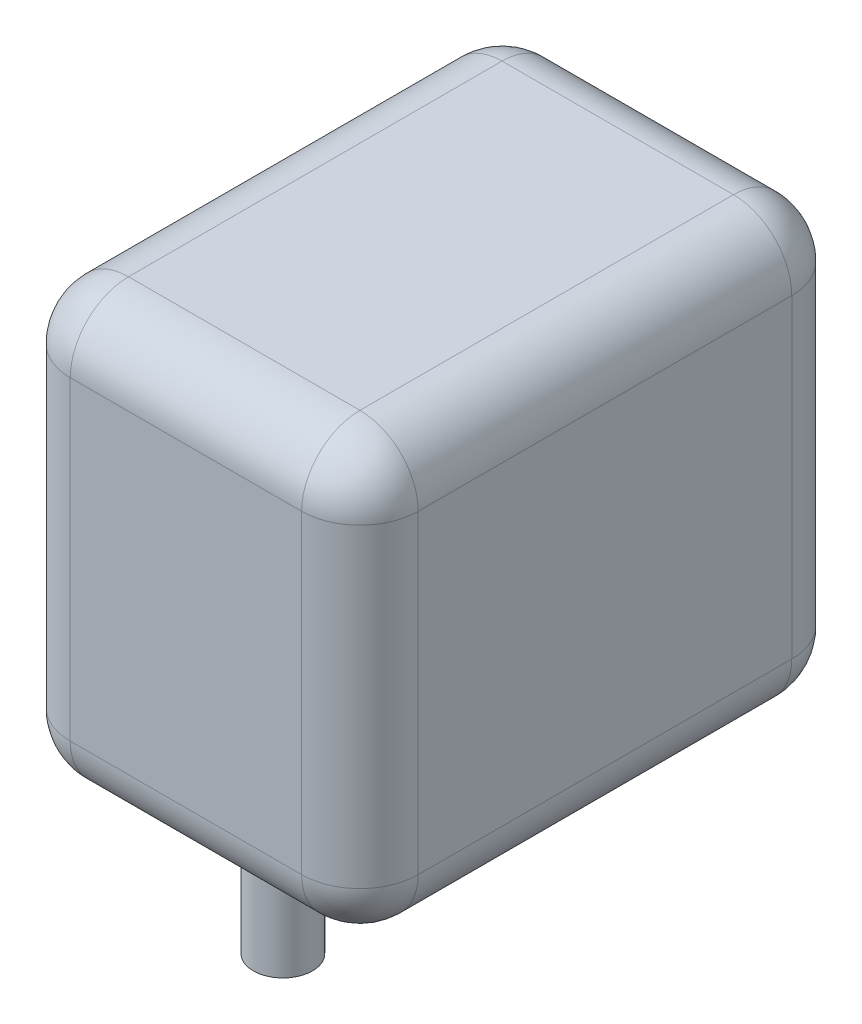
ISO-10303-21;
HEADER;
FILE_DESCRIPTION(('STEP AP214'),'2;1');
FILE_NAME('part.step','',(''),(''),'','','');
FILE_SCHEMA(('AUTOMOTIVE_DESIGN { 1 0 10303 214 1 1 1 1 }'));
ENDSEC;
DATA;
#1=APPLICATION_CONTEXT('core data for automotive mechanical design processes');
#2=APPLICATION_PROTOCOL_DEFINITION('international standard','automotive_design',2000,#1);
#3=PRODUCT_CONTEXT('',#1,'mechanical');
#4=PRODUCT('Part','Part','',(#3));
#5=PRODUCT_RELATED_PRODUCT_CATEGORY('part','',(#4));
#6=PRODUCT_DEFINITION_FORMATION('','',#4);
#7=PRODUCT_DEFINITION_CONTEXT('part definition',#1,'design');
#8=PRODUCT_DEFINITION('design','',#6,#7);
#9=PRODUCT_DEFINITION_SHAPE('','',#8);
#10=(LENGTH_UNIT() NAMED_UNIT(*) SI_UNIT(.MILLI.,.METRE.));
#11=(NAMED_UNIT(*) PLANE_ANGLE_UNIT() SI_UNIT($,.RADIAN.));
#12=(NAMED_UNIT(*) SI_UNIT($,.STERADIAN.) SOLID_ANGLE_UNIT());
#13=UNCERTAINTY_MEASURE_WITH_UNIT(LENGTH_MEASURE(1.E-05),#10,'distance_accuracy_value','');
#14=(GEOMETRIC_REPRESENTATION_CONTEXT(3) GLOBAL_UNCERTAINTY_ASSIGNED_CONTEXT((#13)) GLOBAL_UNIT_ASSIGNED_CONTEXT((#10,
#11,#12)) REPRESENTATION_CONTEXT('',''));
#15=CARTESIAN_POINT('',(0.,0.,0.));
#16=DIRECTION('',(0.,0.,1.));
#17=DIRECTION('',(1.,0.,0.));
#18=AXIS2_PLACEMENT_3D('',#15,#16,#17);
#19=CARTESIAN_POINT('',(29.845,93.98,-42.037));
#20=DIRECTION('',(-1.,0.,0.));
#21=DIRECTION('',(0.,0.,1.));
#22=AXIS2_PLACEMENT_3D('',#19,#20,#21);
#23=PLANE('',#22);
#24=DIRECTION('',(0.,-1.,0.));
#25=VECTOR('',#24,1.);
#26=CARTESIAN_POINT('',(29.845,93.98,-32.037));
#27=LINE('',#26,#25);
#28=CARTESIAN_POINT('',(29.845,30.,-32.037));
#29=VERTEX_POINT('',#28);
#30=CARTESIAN_POINT('',(29.845,83.98,-32.037));
#31=VERTEX_POINT('',#30);
#32=EDGE_CURVE('E189',#29,#31,#27,.F.);
#33=ORIENTED_EDGE('',*,*,#32,.T.);
#34=DIRECTION('',(0.,0.,-1.));
#35=VECTOR('',#34,1.);
#36=CARTESIAN_POINT('',(29.845,83.98,42.037));
#37=LINE('',#36,#35);
#38=CARTESIAN_POINT('',(29.845,83.98,32.037));
#39=VERTEX_POINT('',#38);
#40=EDGE_CURVE('E191',#31,#39,#37,.F.);
#41=ORIENTED_EDGE('',*,*,#40,.T.);
#42=DIRECTION('',(0.,-1.,0.));
#43=VECTOR('',#42,1.);
#44=CARTESIAN_POINT('',(29.845,93.98,32.037));
#45=LINE('',#44,#43);
#46=CARTESIAN_POINT('',(29.845,30.,32.037));
#47=VERTEX_POINT('',#46);
#48=EDGE_CURVE('E185',#39,#47,#45,.T.);
#49=ORIENTED_EDGE('',*,*,#48,.T.);
#50=DIRECTION('',(0.,0.,1.));
#51=VECTOR('',#50,1.);
#52=CARTESIAN_POINT('',(29.845,30.,-42.037));
#53=LINE('',#52,#51);
#54=EDGE_CURVE('E187',#47,#29,#53,.F.);
#55=ORIENTED_EDGE('',*,*,#54,.T.);
#56=EDGE_LOOP('',(#33,#41,#49,#55));
#57=FACE_BOUND('',#56,.T.);
#58=ADVANCED_FACE('F32',(#57),#23,.F.);
#59=CARTESIAN_POINT('',(-29.845,93.98,-42.037));
#60=DIRECTION('',(0.,0.,1.));
#61=DIRECTION('',(1.,0.,0.));
#62=AXIS2_PLACEMENT_3D('',#59,#60,#61);
#63=PLANE('',#62);
#64=DIRECTION('',(0.,-1.,0.));
#65=VECTOR('',#64,1.);
#66=CARTESIAN_POINT('',(-19.845,93.98,-42.037));
#67=LINE('',#66,#65);
#68=CARTESIAN_POINT('',(-19.845,30.,-42.037));
#69=VERTEX_POINT('',#68);
#70=CARTESIAN_POINT('',(-19.845,83.98,-42.037));
#71=VERTEX_POINT('',#70);
#72=EDGE_CURVE('E180',#69,#71,#67,.F.);
#73=ORIENTED_EDGE('',*,*,#72,.T.);
#74=DIRECTION('',(-1.,0.,0.));
#75=VECTOR('',#74,1.);
#76=CARTESIAN_POINT('',(29.845,83.98,-42.037));
#77=LINE('',#76,#75);
#78=CARTESIAN_POINT('',(19.845,83.98,-42.037));
#79=VERTEX_POINT('',#78);
#80=EDGE_CURVE('E182',#71,#79,#77,.F.);
#81=ORIENTED_EDGE('',*,*,#80,.T.);
#82=DIRECTION('',(0.,-1.,0.));
#83=VECTOR('',#82,1.);
#84=CARTESIAN_POINT('',(19.845,93.98,-42.037));
#85=LINE('',#84,#83);
#86=CARTESIAN_POINT('',(19.845,30.,-42.037));
#87=VERTEX_POINT('',#86);
#88=EDGE_CURVE('E176',#79,#87,#85,.T.);
#89=ORIENTED_EDGE('',*,*,#88,.T.);
#90=DIRECTION('',(1.,0.,0.));
#91=VECTOR('',#90,1.);
#92=CARTESIAN_POINT('',(-29.845,30.,-42.037));
#93=LINE('',#92,#91);
#94=EDGE_CURVE('E178',#87,#69,#93,.F.);
#95=ORIENTED_EDGE('',*,*,#94,.T.);
#96=EDGE_LOOP('',(#73,#81,#89,#95));
#97=FACE_BOUND('',#96,.T.);
#98=ADVANCED_FACE('F318',(#97),#63,.F.);
#99=CARTESIAN_POINT('',(-29.845,93.98,-42.037));
#100=DIRECTION('',(1.,0.,0.));
#101=DIRECTION('',(0.,0.,-1.));
#102=AXIS2_PLACEMENT_3D('',#99,#100,#101);
#103=PLANE('',#102);
#104=DIRECTION('',(0.,0.,1.));
#105=VECTOR('',#104,1.);
#106=CARTESIAN_POINT('',(-29.845,83.98,-42.037));
#107=LINE('',#106,#105);
#108=CARTESIAN_POINT('',(-29.845,83.98,32.037));
#109=VERTEX_POINT('',#108);
#110=CARTESIAN_POINT('',(-29.845,83.98,-32.037));
#111=VERTEX_POINT('',#110);
#112=EDGE_CURVE('E128',#109,#111,#107,.F.);
#113=ORIENTED_EDGE('',*,*,#112,.T.);
#114=DIRECTION('',(0.,-1.,0.));
#115=VECTOR('',#114,1.);
#116=CARTESIAN_POINT('',(-29.845,93.98,-32.037));
#117=LINE('',#116,#115);
#118=CARTESIAN_POINT('',(-29.845,30.,-32.037));
#119=VERTEX_POINT('',#118);
#120=EDGE_CURVE('E165',#111,#119,#117,.T.);
#121=ORIENTED_EDGE('',*,*,#120,.T.);
#122=DIRECTION('',(0.,0.,-1.));
#123=VECTOR('',#122,1.);
#124=CARTESIAN_POINT('',(-29.845,30.,42.037));
#125=LINE('',#124,#123);
#126=CARTESIAN_POINT('',(-29.845,30.,32.037));
#127=VERTEX_POINT('',#126);
#128=EDGE_CURVE('E158',#119,#127,#125,.F.);
#129=ORIENTED_EDGE('',*,*,#128,.T.);
#130=DIRECTION('',(0.,-1.,0.));
#131=VECTOR('',#130,1.);
#132=CARTESIAN_POINT('',(-29.845,93.98,32.037));
#133=LINE('',#132,#131);
#134=EDGE_CURVE('E156',#127,#109,#133,.F.);
#135=ORIENTED_EDGE('',*,*,#134,.T.);
#136=EDGE_LOOP('',(#113,#121,#129,#135));
#137=FACE_BOUND('',#136,.T.);
#138=ADVANCED_FACE('F288',(#137),#103,.F.);
#139=CARTESIAN_POINT('',(-29.845,93.98,42.037));
#140=DIRECTION('',(0.,0.,-1.));
#141=DIRECTION('',(-1.,0.,0.));
#142=AXIS2_PLACEMENT_3D('',#139,#140,#141);
#143=PLANE('',#142);
#144=DIRECTION('',(1.,0.,0.));
#145=VECTOR('',#144,1.);
#146=CARTESIAN_POINT('',(-29.845,83.98,42.037));
#147=LINE('',#146,#145);
#148=CARTESIAN_POINT('',(19.845,83.98,42.037));
#149=VERTEX_POINT('',#148);
#150=CARTESIAN_POINT('',(-19.845,83.98,42.037));
#151=VERTEX_POINT('',#150);
#152=EDGE_CURVE('E41',#149,#151,#147,.F.);
#153=ORIENTED_EDGE('',*,*,#152,.T.);
#154=DIRECTION('',(0.,-1.,0.));
#155=VECTOR('',#154,1.);
#156=CARTESIAN_POINT('',(-19.845,93.98,42.037));
#157=LINE('',#156,#155);
#158=CARTESIAN_POINT('',(-19.845,30.,42.037));
#159=VERTEX_POINT('',#158);
#160=EDGE_CURVE('E11',#151,#159,#157,.T.);
#161=ORIENTED_EDGE('',*,*,#160,.T.);
#162=DIRECTION('',(-1.,0.,0.));
#163=VECTOR('',#162,1.);
#164=CARTESIAN_POINT('',(29.845,30.,42.037));
#165=LINE('',#164,#163);
#166=CARTESIAN_POINT('',(19.845,30.,42.037));
#167=VERTEX_POINT('',#166);
#168=EDGE_CURVE('E194',#159,#167,#165,.F.);
#169=ORIENTED_EDGE('',*,*,#168,.T.);
#170=DIRECTION('',(0.,-1.,0.));
#171=VECTOR('',#170,1.);
#172=CARTESIAN_POINT('',(19.845,93.98,42.037));
#173=LINE('',#172,#171);
#174=EDGE_CURVE('E52',#167,#149,#173,.F.);
#175=ORIENTED_EDGE('',*,*,#174,.T.);
#176=EDGE_LOOP('',(#153,#161,#169,#175));
#177=FACE_BOUND('',#176,.T.);
#178=ADVANCED_FACE('F294',(#177),#143,.F.);
#179=CARTESIAN_POINT('',(0.,93.98,0.));
#180=DIRECTION('',(0.,1.,0.));
#181=DIRECTION('',(0.,0.,1.));
#182=AXIS2_PLACEMENT_3D('',#179,#180,#181);
#183=PLANE('',#182);
#184=DIRECTION('',(-1.,0.,0.));
#185=VECTOR('',#184,1.);
#186=CARTESIAN_POINT('',(-29.845,93.98,-32.037));
#187=LINE('',#186,#185);
#188=CARTESIAN_POINT('',(19.845,93.98,-32.037));
#189=VERTEX_POINT('',#188);
#190=CARTESIAN_POINT('',(-19.845,93.98,-32.037));
#191=VERTEX_POINT('',#190);
#192=EDGE_CURVE('E154',#189,#191,#187,.T.);
#193=ORIENTED_EDGE('',*,*,#192,.T.);
#194=DIRECTION('',(0.,0.,1.));
#195=VECTOR('',#194,1.);
#196=CARTESIAN_POINT('',(-19.845,93.98,42.037));
#197=LINE('',#196,#195);
#198=CARTESIAN_POINT('',(-19.845,93.98,32.037));
#199=VERTEX_POINT('',#198);
#200=EDGE_CURVE('E126',#191,#199,#197,.T.);
#201=ORIENTED_EDGE('',*,*,#200,.T.);
#202=DIRECTION('',(1.,0.,0.));
#203=VECTOR('',#202,1.);
#204=CARTESIAN_POINT('',(29.845,93.98,32.037));
#205=LINE('',#204,#203);
#206=CARTESIAN_POINT('',(19.845,93.98,32.037));
#207=VERTEX_POINT('',#206);
#208=EDGE_CURVE('E143',#199,#207,#205,.T.);
#209=ORIENTED_EDGE('',*,*,#208,.T.);
#210=DIRECTION('',(0.,0.,-1.));
#211=VECTOR('',#210,1.);
#212=CARTESIAN_POINT('',(19.845,93.98,-42.037));
#213=LINE('',#212,#211);
#214=EDGE_CURVE('E149',#207,#189,#213,.T.);
#215=ORIENTED_EDGE('',*,*,#214,.T.);
#216=EDGE_LOOP('',(#193,#201,#209,#215));
#217=FACE_BOUND('',#216,.T.);
#218=ADVANCED_FACE('F152',(#217),#183,.T.);
#219=CARTESIAN_POINT('',(0.,20.,25.4));
#220=DIRECTION('',(0.,-1.,0.));
#221=DIRECTION('',(0.,0.,-1.));
#222=AXIS2_PLACEMENT_3D('',#219,#220,#221);
#223=CYLINDRICAL_SURFACE('',#222,5.08);
#224=CARTESIAN_POINT('',(0.,20.,25.4));
#225=DIRECTION('',(0.,-1.,0.));
#226=DIRECTION('',(0.,0.,-1.));
#227=AXIS2_PLACEMENT_3D('',#224,#225,#226);
#228=CIRCLE('',#227,5.08);
#229=CARTESIAN_POINT('',(0.,20.,20.32));
#230=VERTEX_POINT('',#229);
#231=EDGE_CURVE('E150',#230,#230,#228,.T.);
#232=ORIENTED_EDGE('',*,*,#231,.T.);
#233=EDGE_LOOP('',(#232));
#234=FACE_BOUND('',#233,.T.);
#235=CARTESIAN_POINT('',(0.,0.,25.4));
#236=DIRECTION('',(0.,-1.,0.));
#237=DIRECTION('',(0.,0.,-1.));
#238=AXIS2_PLACEMENT_3D('',#235,#236,#237);
#239=CIRCLE('',#238,5.08);
#240=CARTESIAN_POINT('',(0.,0.,20.32));
#241=VERTEX_POINT('',#240);
#242=EDGE_CURVE('E253',#241,#241,#239,.T.);
#243=ORIENTED_EDGE('',*,*,#242,.F.);
#244=EDGE_LOOP('',(#243));
#245=FACE_BOUND('',#244,.T.);
#246=ADVANCED_FACE('F483',(#234,#245),#223,.T.);
#247=CARTESIAN_POINT('',(0.,20.,0.));
#248=DIRECTION('',(0.,-1.,0.));
#249=DIRECTION('',(0.,0.,-1.));
#250=AXIS2_PLACEMENT_3D('',#247,#248,#249);
#251=PLANE('',#250);
#252=DIRECTION('',(-1.,0.,0.));
#253=VECTOR('',#252,1.);
#254=CARTESIAN_POINT('',(-29.845,20.,32.037));
#255=LINE('',#254,#253);
#256=CARTESIAN_POINT('',(19.845,20.,32.037));
#257=VERTEX_POINT('',#256);
#258=CARTESIAN_POINT('',(-19.845,20.,32.037));
#259=VERTEX_POINT('',#258);
#260=EDGE_CURVE('E167',#257,#259,#255,.T.);
#261=ORIENTED_EDGE('',*,*,#260,.T.);
#262=DIRECTION('',(0.,0.,-1.));
#263=VECTOR('',#262,1.);
#264=CARTESIAN_POINT('',(-19.845,20.,-42.037));
#265=LINE('',#264,#263);
#266=CARTESIAN_POINT('',(-19.845,20.,-32.037));
#267=VERTEX_POINT('',#266);
#268=EDGE_CURVE('E173',#259,#267,#265,.T.);
#269=ORIENTED_EDGE('',*,*,#268,.T.);
#270=DIRECTION('',(1.,0.,0.));
#271=VECTOR('',#270,1.);
#272=CARTESIAN_POINT('',(29.845,20.,-32.037));
#273=LINE('',#272,#271);
#274=CARTESIAN_POINT('',(19.845,20.,-32.037));
#275=VERTEX_POINT('',#274);
#276=EDGE_CURVE('E171',#267,#275,#273,.T.);
#277=ORIENTED_EDGE('',*,*,#276,.T.);
#278=DIRECTION('',(0.,0.,1.));
#279=VECTOR('',#278,1.);
#280=CARTESIAN_POINT('',(19.845,20.,42.037));
#281=LINE('',#280,#279);
#282=EDGE_CURVE('E169',#275,#257,#281,.T.);
#283=ORIENTED_EDGE('',*,*,#282,.T.);
#284=EDGE_LOOP('',(#261,#269,#277,#283));
#285=FACE_BOUND('',#284,.T.);
#286=ORIENTED_EDGE('',*,*,#231,.F.);
#287=EDGE_LOOP('',(#286));
#288=FACE_BOUND('',#287,.T.);
#289=ADVANCED_FACE('F478',(#285,#288),#251,.T.);
#290=CARTESIAN_POINT('',(0.,0.,0.));
#291=DIRECTION('',(0.,1.,0.));
#292=DIRECTION('',(0.,0.,1.));
#293=AXIS2_PLACEMENT_3D('',#290,#291,#292);
#294=PLANE('',#293);
#295=ORIENTED_EDGE('',*,*,#242,.T.);
#296=EDGE_LOOP('',(#295));
#297=FACE_BOUND('',#296,.T.);
#298=ADVANCED_FACE('F474',(#297),#294,.F.);
#299=CARTESIAN_POINT('',(19.845,30.,0.));
#300=DIRECTION('',(0.,0.,-1.));
#301=DIRECTION('',(-1.,0.,0.));
#302=AXIS2_PLACEMENT_3D('',#299,#300,#301);
#303=CYLINDRICAL_SURFACE('',#302,10.);
#304=CARTESIAN_POINT('',(19.845,30.,-32.037));
#305=DIRECTION('',(0.,0.,-1.));
#306=DIRECTION('',(-1.,0.,0.));
#307=AXIS2_PLACEMENT_3D('',#304,#305,#306);
#308=CIRCLE('',#307,10.);
#309=EDGE_CURVE('E36',#29,#275,#308,.T.);
#310=ORIENTED_EDGE('',*,*,#309,.F.);
#311=ORIENTED_EDGE('',*,*,#54,.F.);
#312=CARTESIAN_POINT('',(19.845,30.,32.037));
#313=DIRECTION('',(0.,0.,1.));
#314=DIRECTION('',(1.,0.,0.));
#315=AXIS2_PLACEMENT_3D('',#312,#313,#314);
#316=CIRCLE('',#315,10.);
#317=EDGE_CURVE('E246',#257,#47,#316,.T.);
#318=ORIENTED_EDGE('',*,*,#317,.F.);
#319=ORIENTED_EDGE('',*,*,#282,.F.);
#320=EDGE_LOOP('',(#310,#311,#318,#319));
#321=FACE_BOUND('',#320,.T.);
#322=ADVANCED_FACE('F34',(#321),#303,.T.);
#323=CARTESIAN_POINT('',(19.845,30.,-32.037));
#324=DIRECTION('',(0.,0.,1.));
#325=DIRECTION('',(1.,0.,0.));
#326=AXIS2_PLACEMENT_3D('',#323,#324,#325);
#327=SPHERICAL_SURFACE('',#326,10.);
#328=CARTESIAN_POINT('',(19.845,30.,-32.037));
#329=DIRECTION('',(0.,-1.,0.));
#330=DIRECTION('',(0.,0.,-1.));
#331=AXIS2_PLACEMENT_3D('',#328,#329,#330);
#332=CIRCLE('',#331,10.);
#333=EDGE_CURVE('E241',#29,#87,#332,.F.);
#334=ORIENTED_EDGE('',*,*,#333,.F.);
#335=ORIENTED_EDGE('',*,*,#309,.T.);
#336=CARTESIAN_POINT('',(19.845,30.,-32.037));
#337=DIRECTION('',(1.,0.,0.));
#338=DIRECTION('',(0.,0.,-1.));
#339=AXIS2_PLACEMENT_3D('',#336,#337,#338);
#340=CIRCLE('',#339,10.);
#341=EDGE_CURVE('E244',#87,#275,#340,.F.);
#342=ORIENTED_EDGE('',*,*,#341,.F.);
#343=EDGE_LOOP('',(#334,#335,#342));
#344=FACE_BOUND('',#343,.T.);
#345=ADVANCED_FACE('F460',(#344),#327,.T.);
#346=CARTESIAN_POINT('',(19.845,30.,32.037));
#347=DIRECTION('',(0.,0.,1.));
#348=DIRECTION('',(1.,0.,0.));
#349=AXIS2_PLACEMENT_3D('',#346,#347,#348);
#350=SPHERICAL_SURFACE('',#349,10.);
#351=CARTESIAN_POINT('',(19.845,30.,32.037));
#352=DIRECTION('',(1.,0.,0.));
#353=DIRECTION('',(0.,0.,-1.));
#354=AXIS2_PLACEMENT_3D('',#351,#352,#353);
#355=CIRCLE('',#354,10.);
#356=EDGE_CURVE('E235',#257,#167,#355,.F.);
#357=ORIENTED_EDGE('',*,*,#356,.F.);
#358=ORIENTED_EDGE('',*,*,#317,.T.);
#359=CARTESIAN_POINT('',(19.845,30.,32.037));
#360=DIRECTION('',(0.,-1.,0.));
#361=DIRECTION('',(0.,0.,-1.));
#362=AXIS2_PLACEMENT_3D('',#359,#360,#361);
#363=CIRCLE('',#362,10.);
#364=EDGE_CURVE('E238',#167,#47,#363,.F.);
#365=ORIENTED_EDGE('',*,*,#364,.F.);
#366=EDGE_LOOP('',(#357,#358,#365));
#367=FACE_BOUND('',#366,.T.);
#368=ADVANCED_FACE('F300',(#367),#350,.T.);
#369=CARTESIAN_POINT('',(0.,30.,-32.037));
#370=DIRECTION('',(-1.,0.,0.));
#371=DIRECTION('',(0.,0.,1.));
#372=AXIS2_PLACEMENT_3D('',#369,#370,#371);
#373=CYLINDRICAL_SURFACE('',#372,10.);
#374=ORIENTED_EDGE('',*,*,#341,.T.);
#375=ORIENTED_EDGE('',*,*,#276,.F.);
#376=CARTESIAN_POINT('',(-19.845,30.,-32.037));
#377=DIRECTION('',(-1.,0.,0.));
#378=DIRECTION('',(0.,0.,1.));
#379=AXIS2_PLACEMENT_3D('',#376,#377,#378);
#380=CIRCLE('',#379,10.);
#381=EDGE_CURVE('E230',#69,#267,#380,.T.);
#382=ORIENTED_EDGE('',*,*,#381,.F.);
#383=ORIENTED_EDGE('',*,*,#94,.F.);
#384=EDGE_LOOP('',(#374,#375,#382,#383));
#385=FACE_BOUND('',#384,.T.);
#386=ADVANCED_FACE('F443',(#385),#373,.T.);
#387=CARTESIAN_POINT('',(19.845,93.98,-32.037));
#388=DIRECTION('',(0.,-1.,0.));
#389=DIRECTION('',(0.,0.,-1.));
#390=AXIS2_PLACEMENT_3D('',#387,#388,#389);
#391=CYLINDRICAL_SURFACE('',#390,10.);
#392=ORIENTED_EDGE('',*,*,#333,.T.);
#393=ORIENTED_EDGE('',*,*,#88,.F.);
#394=CARTESIAN_POINT('',(19.845,83.98,-32.037));
#395=DIRECTION('',(0.,1.,0.));
#396=DIRECTION('',(0.,0.,1.));
#397=AXIS2_PLACEMENT_3D('',#394,#395,#396);
#398=CIRCLE('',#397,10.);
#399=EDGE_CURVE('E227',#31,#79,#398,.T.);
#400=ORIENTED_EDGE('',*,*,#399,.F.);
#401=ORIENTED_EDGE('',*,*,#32,.F.);
#402=EDGE_LOOP('',(#392,#393,#400,#401));
#403=FACE_BOUND('',#402,.T.);
#404=ADVANCED_FACE('F435',(#403),#391,.T.);
#405=CARTESIAN_POINT('',(19.845,83.98,0.));
#406=DIRECTION('',(0.,0.,1.));
#407=DIRECTION('',(1.,0.,0.));
#408=AXIS2_PLACEMENT_3D('',#405,#406,#407);
#409=CYLINDRICAL_SURFACE('',#408,10.);
#410=CARTESIAN_POINT('',(19.845,83.98,32.037));
#411=DIRECTION('',(0.,0.,1.));
#412=DIRECTION('',(0.,-1.,0.));
#413=AXIS2_PLACEMENT_3D('',#410,#411,#412);
#414=CIRCLE('',#413,10.);
#415=EDGE_CURVE('E221',#39,#207,#414,.T.);
#416=ORIENTED_EDGE('',*,*,#415,.F.);
#417=ORIENTED_EDGE('',*,*,#40,.F.);
#418=CARTESIAN_POINT('',(19.845,83.98,-32.037));
#419=DIRECTION('',(0.,0.,-1.));
#420=DIRECTION('',(-1.,0.,0.));
#421=AXIS2_PLACEMENT_3D('',#418,#419,#420);
#422=CIRCLE('',#421,10.);
#423=EDGE_CURVE('E224',#189,#31,#422,.T.);
#424=ORIENTED_EDGE('',*,*,#423,.F.);
#425=ORIENTED_EDGE('',*,*,#214,.F.);
#426=EDGE_LOOP('',(#416,#417,#424,#425));
#427=FACE_BOUND('',#426,.T.);
#428=ADVANCED_FACE('F269',(#427),#409,.T.);
#429=CARTESIAN_POINT('',(19.845,93.98,32.037));
#430=DIRECTION('',(0.,-1.,0.));
#431=DIRECTION('',(0.,0.,-1.));
#432=AXIS2_PLACEMENT_3D('',#429,#430,#431);
#433=CYLINDRICAL_SURFACE('',#432,10.);
#434=ORIENTED_EDGE('',*,*,#364,.T.);
#435=ORIENTED_EDGE('',*,*,#48,.F.);
#436=CARTESIAN_POINT('',(19.845,83.98,32.037));
#437=DIRECTION('',(0.,1.,0.));
#438=DIRECTION('',(0.,0.,1.));
#439=AXIS2_PLACEMENT_3D('',#436,#437,#438);
#440=CIRCLE('',#439,10.);
#441=EDGE_CURVE('E219',#149,#39,#440,.T.);
#442=ORIENTED_EDGE('',*,*,#441,.F.);
#443=ORIENTED_EDGE('',*,*,#174,.F.);
#444=EDGE_LOOP('',(#434,#435,#442,#443));
#445=FACE_BOUND('',#444,.T.);
#446=ADVANCED_FACE('F303',(#445),#433,.T.);
#447=CARTESIAN_POINT('',(0.,30.,32.037));
#448=DIRECTION('',(1.,0.,0.));
#449=DIRECTION('',(0.,0.,-1.));
#450=AXIS2_PLACEMENT_3D('',#447,#448,#449);
#451=CYLINDRICAL_SURFACE('',#450,10.);
#452=ORIENTED_EDGE('',*,*,#356,.T.);
#453=ORIENTED_EDGE('',*,*,#168,.F.);
#454=CARTESIAN_POINT('',(-19.845,30.,32.037));
#455=DIRECTION('',(-1.,0.,0.));
#456=DIRECTION('',(0.,0.,1.));
#457=AXIS2_PLACEMENT_3D('',#454,#455,#456);
#458=CIRCLE('',#457,10.);
#459=EDGE_CURVE('E216',#259,#159,#458,.T.);
#460=ORIENTED_EDGE('',*,*,#459,.F.);
#461=ORIENTED_EDGE('',*,*,#260,.F.);
#462=EDGE_LOOP('',(#452,#453,#460,#461));
#463=FACE_BOUND('',#462,.T.);
#464=ADVANCED_FACE('F299',(#463),#451,.T.);
#465=CARTESIAN_POINT('',(-19.845,30.,0.));
#466=DIRECTION('',(0.,0.,1.));
#467=DIRECTION('',(1.,0.,0.));
#468=AXIS2_PLACEMENT_3D('',#465,#466,#467);
#469=CYLINDRICAL_SURFACE('',#468,10.);
#470=CARTESIAN_POINT('',(-19.845,30.,-32.037));
#471=DIRECTION('',(0.,0.,-1.));
#472=DIRECTION('',(-1.,0.,0.));
#473=AXIS2_PLACEMENT_3D('',#470,#471,#472);
#474=CIRCLE('',#473,10.);
#475=EDGE_CURVE('E232',#267,#119,#474,.T.);
#476=ORIENTED_EDGE('',*,*,#475,.F.);
#477=ORIENTED_EDGE('',*,*,#268,.F.);
#478=CARTESIAN_POINT('',(-19.845,30.,32.037));
#479=DIRECTION('',(0.,0.,1.));
#480=DIRECTION('',(1.,0.,0.));
#481=AXIS2_PLACEMENT_3D('',#478,#479,#480);
#482=CIRCLE('',#481,10.);
#483=EDGE_CURVE('E213',#127,#259,#482,.T.);
#484=ORIENTED_EDGE('',*,*,#483,.F.);
#485=ORIENTED_EDGE('',*,*,#128,.F.);
#486=EDGE_LOOP('',(#476,#477,#484,#485));
#487=FACE_BOUND('',#486,.T.);
#488=ADVANCED_FACE('F404',(#487),#469,.T.);
#489=CARTESIAN_POINT('',(-19.845,30.,-32.037));
#490=DIRECTION('',(0.,0.,1.));
#491=DIRECTION('',(1.,0.,0.));
#492=AXIS2_PLACEMENT_3D('',#489,#490,#491);
#493=SPHERICAL_SURFACE('',#492,10.);
#494=ORIENTED_EDGE('',*,*,#381,.T.);
#495=ORIENTED_EDGE('',*,*,#475,.T.);
#496=CARTESIAN_POINT('',(-19.845,30.,-32.037));
#497=DIRECTION('',(0.,-1.,0.));
#498=DIRECTION('',(0.,0.,-1.));
#499=AXIS2_PLACEMENT_3D('',#496,#497,#498);
#500=CIRCLE('',#499,10.);
#501=EDGE_CURVE('E210',#69,#119,#500,.F.);
#502=ORIENTED_EDGE('',*,*,#501,.F.);
#503=EDGE_LOOP('',(#494,#495,#502));
#504=FACE_BOUND('',#503,.T.);
#505=ADVANCED_FACE('F315',(#504),#493,.T.);
#506=CARTESIAN_POINT('',(19.845,83.98,-32.037));
#507=DIRECTION('',(0.,0.,1.));
#508=DIRECTION('',(1.,0.,0.));
#509=AXIS2_PLACEMENT_3D('',#506,#507,#508);
#510=SPHERICAL_SURFACE('',#509,10.);
#511=ORIENTED_EDGE('',*,*,#423,.T.);
#512=ORIENTED_EDGE('',*,*,#399,.T.);
#513=CARTESIAN_POINT('',(19.845,83.98,-32.037));
#514=DIRECTION('',(1.,0.,0.));
#515=DIRECTION('',(0.,1.,0.));
#516=AXIS2_PLACEMENT_3D('',#513,#514,#515);
#517=CIRCLE('',#516,10.);
#518=EDGE_CURVE('E208',#189,#79,#517,.F.);
#519=ORIENTED_EDGE('',*,*,#518,.F.);
#520=EDGE_LOOP('',(#511,#512,#519));
#521=FACE_BOUND('',#520,.T.);
#522=ADVANCED_FACE('F272',(#521),#510,.T.);
#523=CARTESIAN_POINT('',(19.845,83.98,32.037));
#524=DIRECTION('',(0.,0.,1.));
#525=DIRECTION('',(1.,0.,0.));
#526=AXIS2_PLACEMENT_3D('',#523,#524,#525);
#527=SPHERICAL_SURFACE('',#526,10.);
#528=ORIENTED_EDGE('',*,*,#441,.T.);
#529=ORIENTED_EDGE('',*,*,#415,.T.);
#530=CARTESIAN_POINT('',(19.845,83.98,32.037));
#531=DIRECTION('',(1.,0.,0.));
#532=DIRECTION('',(0.,0.,-1.));
#533=AXIS2_PLACEMENT_3D('',#530,#531,#532);
#534=CIRCLE('',#533,10.);
#535=EDGE_CURVE('E146',#149,#207,#534,.F.);
#536=ORIENTED_EDGE('',*,*,#535,.F.);
#537=EDGE_LOOP('',(#528,#529,#536));
#538=FACE_BOUND('',#537,.T.);
#539=ADVANCED_FACE('F305',(#538),#527,.T.);
#540=CARTESIAN_POINT('',(-19.845,30.,32.037));
#541=DIRECTION('',(0.,0.,1.));
#542=DIRECTION('',(1.,0.,0.));
#543=AXIS2_PLACEMENT_3D('',#540,#541,#542);
#544=SPHERICAL_SURFACE('',#543,10.);
#545=ORIENTED_EDGE('',*,*,#483,.T.);
#546=ORIENTED_EDGE('',*,*,#459,.T.);
#547=CARTESIAN_POINT('',(-19.845,30.,32.037));
#548=DIRECTION('',(0.,-1.,0.));
#549=DIRECTION('',(0.,0.,-1.));
#550=AXIS2_PLACEMENT_3D('',#547,#548,#549);
#551=CIRCLE('',#550,10.);
#552=EDGE_CURVE('E205',#127,#159,#551,.F.);
#553=ORIENTED_EDGE('',*,*,#552,.F.);
#554=EDGE_LOOP('',(#545,#546,#553));
#555=FACE_BOUND('',#554,.T.);
#556=ADVANCED_FACE('F307',(#555),#544,.T.);
#557=CARTESIAN_POINT('',(-19.845,93.98,-32.037));
#558=DIRECTION('',(0.,-1.,0.));
#559=DIRECTION('',(0.,0.,-1.));
#560=AXIS2_PLACEMENT_3D('',#557,#558,#559);
#561=CYLINDRICAL_SURFACE('',#560,10.);
#562=ORIENTED_EDGE('',*,*,#501,.T.);
#563=ORIENTED_EDGE('',*,*,#120,.F.);
#564=CARTESIAN_POINT('',(-19.845,83.98,-32.037));
#565=DIRECTION('',(0.,1.,0.));
#566=DIRECTION('',(0.,0.,1.));
#567=AXIS2_PLACEMENT_3D('',#564,#565,#566);
#568=CIRCLE('',#567,10.);
#569=EDGE_CURVE('E202',#71,#111,#568,.T.);
#570=ORIENTED_EDGE('',*,*,#569,.F.);
#571=ORIENTED_EDGE('',*,*,#72,.F.);
#572=EDGE_LOOP('',(#562,#563,#570,#571));
#573=FACE_BOUND('',#572,.T.);
#574=ADVANCED_FACE('F284',(#573),#561,.T.);
#575=CARTESIAN_POINT('',(0.,83.98,-32.037));
#576=DIRECTION('',(1.,0.,0.));
#577=DIRECTION('',(0.,0.,-1.));
#578=AXIS2_PLACEMENT_3D('',#575,#576,#577);
#579=CYLINDRICAL_SURFACE('',#578,10.);
#580=ORIENTED_EDGE('',*,*,#518,.T.);
#581=ORIENTED_EDGE('',*,*,#80,.F.);
#582=CARTESIAN_POINT('',(-19.845,83.98,-32.037));
#583=DIRECTION('',(-1.,0.,0.));
#584=DIRECTION('',(0.,0.,1.));
#585=AXIS2_PLACEMENT_3D('',#582,#583,#584);
#586=CIRCLE('',#585,10.);
#587=EDGE_CURVE('E140',#191,#71,#586,.T.);
#588=ORIENTED_EDGE('',*,*,#587,.F.);
#589=ORIENTED_EDGE('',*,*,#192,.F.);
#590=EDGE_LOOP('',(#580,#581,#588,#589));
#591=FACE_BOUND('',#590,.T.);
#592=ADVANCED_FACE('F276',(#591),#579,.T.);
#593=CARTESIAN_POINT('',(0.,83.98,32.037));
#594=DIRECTION('',(-1.,0.,0.));
#595=DIRECTION('',(0.,0.,1.));
#596=AXIS2_PLACEMENT_3D('',#593,#594,#595);
#597=CYLINDRICAL_SURFACE('',#596,10.);
#598=ORIENTED_EDGE('',*,*,#535,.T.);
#599=ORIENTED_EDGE('',*,*,#208,.F.);
#600=CARTESIAN_POINT('',(-19.845,83.98,32.037));
#601=DIRECTION('',(-1.,0.,0.));
#602=DIRECTION('',(0.,0.,1.));
#603=AXIS2_PLACEMENT_3D('',#600,#601,#602);
#604=CIRCLE('',#603,10.);
#605=EDGE_CURVE('E134',#151,#199,#604,.T.);
#606=ORIENTED_EDGE('',*,*,#605,.F.);
#607=ORIENTED_EDGE('',*,*,#152,.F.);
#608=EDGE_LOOP('',(#598,#599,#606,#607));
#609=FACE_BOUND('',#608,.T.);
#610=ADVANCED_FACE('F144',(#609),#597,.T.);
#611=CARTESIAN_POINT('',(-19.845,93.98,32.037));
#612=DIRECTION('',(0.,-1.,0.));
#613=DIRECTION('',(0.,0.,-1.));
#614=AXIS2_PLACEMENT_3D('',#611,#612,#613);
#615=CYLINDRICAL_SURFACE('',#614,10.);
#616=ORIENTED_EDGE('',*,*,#552,.T.);
#617=ORIENTED_EDGE('',*,*,#160,.F.);
#618=CARTESIAN_POINT('',(-19.845,83.98,32.037));
#619=DIRECTION('',(0.,1.,0.));
#620=DIRECTION('',(0.,0.,1.));
#621=AXIS2_PLACEMENT_3D('',#618,#619,#620);
#622=CIRCLE('',#621,10.);
#623=EDGE_CURVE('E138',#109,#151,#622,.T.);
#624=ORIENTED_EDGE('',*,*,#623,.F.);
#625=ORIENTED_EDGE('',*,*,#134,.F.);
#626=EDGE_LOOP('',(#616,#617,#624,#625));
#627=FACE_BOUND('',#626,.T.);
#628=ADVANCED_FACE('F292',(#627),#615,.T.);
#629=CARTESIAN_POINT('',(-19.845,83.98,-32.037));
#630=DIRECTION('',(0.,0.,1.));
#631=DIRECTION('',(1.,0.,0.));
#632=AXIS2_PLACEMENT_3D('',#629,#630,#631);
#633=SPHERICAL_SURFACE('',#632,10.);
#634=ORIENTED_EDGE('',*,*,#587,.T.);
#635=ORIENTED_EDGE('',*,*,#569,.T.);
#636=CARTESIAN_POINT('',(-19.845,83.98,-32.037));
#637=DIRECTION('',(0.,0.,-1.));
#638=DIRECTION('',(-1.,0.,0.));
#639=AXIS2_PLACEMENT_3D('',#636,#637,#638);
#640=CIRCLE('',#639,10.);
#641=EDGE_CURVE('E131',#191,#111,#640,.F.);
#642=ORIENTED_EDGE('',*,*,#641,.F.);
#643=EDGE_LOOP('',(#634,#635,#642));
#644=FACE_BOUND('',#643,.T.);
#645=ADVANCED_FACE('F280',(#644),#633,.T.);
#646=CARTESIAN_POINT('',(-19.845,83.98,32.037));
#647=DIRECTION('',(0.,0.,1.));
#648=DIRECTION('',(1.,0.,0.));
#649=AXIS2_PLACEMENT_3D('',#646,#647,#648);
#650=SPHERICAL_SURFACE('',#649,10.);
#651=ORIENTED_EDGE('',*,*,#623,.T.);
#652=ORIENTED_EDGE('',*,*,#605,.T.);
#653=CARTESIAN_POINT('',(-19.845,83.98,32.037));
#654=DIRECTION('',(0.,0.,1.));
#655=DIRECTION('',(1.,0.,0.));
#656=AXIS2_PLACEMENT_3D('',#653,#654,#655);
#657=CIRCLE('',#656,10.);
#658=EDGE_CURVE('E122',#109,#199,#657,.F.);
#659=ORIENTED_EDGE('',*,*,#658,.F.);
#660=EDGE_LOOP('',(#651,#652,#659));
#661=FACE_BOUND('',#660,.T.);
#662=ADVANCED_FACE('F136',(#661),#650,.T.);
#663=CARTESIAN_POINT('',(-19.845,83.98,0.));
#664=DIRECTION('',(0.,0.,-1.));
#665=DIRECTION('',(-1.,0.,0.));
#666=AXIS2_PLACEMENT_3D('',#663,#664,#665);
#667=CYLINDRICAL_SURFACE('',#666,10.);
#668=ORIENTED_EDGE('',*,*,#641,.T.);
#669=ORIENTED_EDGE('',*,*,#112,.F.);
#670=ORIENTED_EDGE('',*,*,#658,.T.);
#671=ORIENTED_EDGE('',*,*,#200,.F.);
#672=EDGE_LOOP('',(#668,#669,#670,#671));
#673=FACE_BOUND('',#672,.T.);
#674=ADVANCED_FACE('F124',(#673),#667,.T.);
#675=CLOSED_SHELL('',(#58,#98,#138,#178,#218,#246,#289,#298,#322,#345,#368,#386,#404,#428,#446,
#464,#488,#505,#522,#539,#556,#574,#592,#610,#628,#645,#662,#674));
#676=MANIFOLD_SOLID_BREP('B2',#675);
#677=ADVANCED_BREP_SHAPE_REPRESENTATION('',(#18,#676),#14);
#678=SHAPE_DEFINITION_REPRESENTATION(#9,#677);
ENDSEC;
END-ISO-10303-21;
